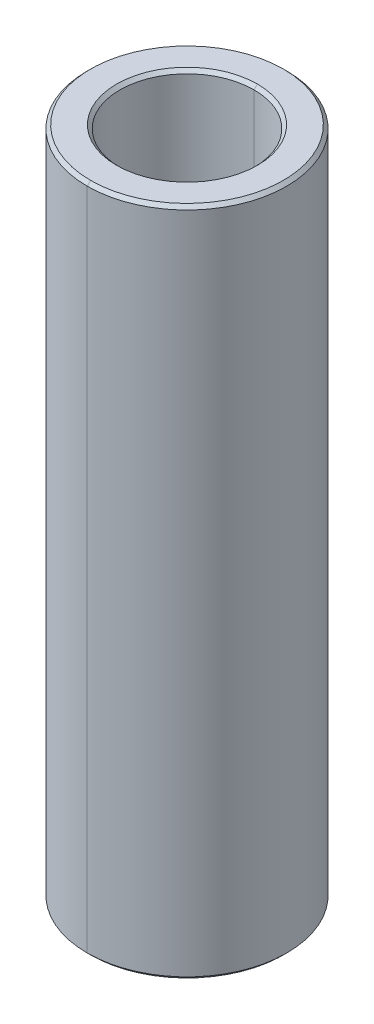
ISO-10303-21;
HEADER;
FILE_DESCRIPTION(('STEP AP214'),'2;1');
FILE_NAME('part.step','',(''),(''),'','','');
FILE_SCHEMA(('AUTOMOTIVE_DESIGN { 1 0 10303 214 1 1 1 1 }'));
ENDSEC;
DATA;
#1=APPLICATION_CONTEXT('core data for automotive mechanical design processes');
#2=APPLICATION_PROTOCOL_DEFINITION('international standard','automotive_design',2000,#1);
#3=PRODUCT_CONTEXT('',#1,'mechanical');
#4=PRODUCT('Part','Part','',(#3));
#5=PRODUCT_RELATED_PRODUCT_CATEGORY('part','',(#4));
#6=PRODUCT_DEFINITION_FORMATION('','',#4);
#7=PRODUCT_DEFINITION_CONTEXT('part definition',#1,'design');
#8=PRODUCT_DEFINITION('design','',#6,#7);
#9=PRODUCT_DEFINITION_SHAPE('','',#8);
#10=(LENGTH_UNIT() NAMED_UNIT(*) SI_UNIT(.MILLI.,.METRE.));
#11=(NAMED_UNIT(*) PLANE_ANGLE_UNIT() SI_UNIT($,.RADIAN.));
#12=(NAMED_UNIT(*) SI_UNIT($,.STERADIAN.) SOLID_ANGLE_UNIT());
#13=UNCERTAINTY_MEASURE_WITH_UNIT(LENGTH_MEASURE(1.E-05),#10,'distance_accuracy_value','');
#14=(GEOMETRIC_REPRESENTATION_CONTEXT(3) GLOBAL_UNCERTAINTY_ASSIGNED_CONTEXT((#13)) GLOBAL_UNIT_ASSIGNED_CONTEXT((#10,
#11,#12)) REPRESENTATION_CONTEXT('',''));
#15=CARTESIAN_POINT('',(0.,0.,0.));
#16=DIRECTION('',(0.,0.,1.));
#17=DIRECTION('',(1.,0.,0.));
#18=AXIS2_PLACEMENT_3D('',#15,#16,#17);
#19=CARTESIAN_POINT('',(0.,9.9,0.));
#20=DIRECTION('',(0.,1.,0.));
#21=DIRECTION('',(0.,0.,1.));
#22=AXIS2_PLACEMENT_3D('',#19,#20,#21);
#23=CONICAL_SURFACE('',#22,2.,0.785398163397448);
#24=DIRECTION('',(0.,0.707106781186548,-0.707106781186548));
#25=VECTOR('',#24,1.);
#26=CARTESIAN_POINT('',(0.,9.9,-2.));
#27=LINE('',#26,#25);
#28=CARTESIAN_POINT('',(0.,9.9,-2.));
#29=VERTEX_POINT('',#28);
#30=CARTESIAN_POINT('',(0.,10.,-2.1));
#31=VERTEX_POINT('',#30);
#32=EDGE_CURVE('E184',#29,#31,#27,.T.);
#33=ORIENTED_EDGE('',*,*,#32,.F.);
#34=CARTESIAN_POINT('',(0.,9.9,0.));
#35=DIRECTION('',(0.,1.,0.));
#36=DIRECTION('',(0.,0.,1.));
#37=AXIS2_PLACEMENT_3D('',#34,#35,#36);
#38=CIRCLE('',#37,2.);
#39=CARTESIAN_POINT('',(0.,9.9,2.));
#40=VERTEX_POINT('',#39);
#41=EDGE_CURVE('E26',#40,#29,#38,.T.);
#42=ORIENTED_EDGE('',*,*,#41,.F.);
#43=DIRECTION('',(0.,0.707106781186548,0.707106781186548));
#44=VECTOR('',#43,1.);
#45=CARTESIAN_POINT('',(0.,9.9,2.));
#46=LINE('',#45,#44);
#47=CARTESIAN_POINT('',(0.,10.,2.1));
#48=VERTEX_POINT('',#47);
#49=EDGE_CURVE('E192',#40,#48,#46,.T.);
#50=ORIENTED_EDGE('',*,*,#49,.T.);
#51=CARTESIAN_POINT('',(0.,10.,0.));
#52=DIRECTION('',(0.,-1.,0.));
#53=DIRECTION('',(0.,0.,1.));
#54=AXIS2_PLACEMENT_3D('',#51,#52,#53);
#55=CIRCLE('',#54,2.1);
#56=EDGE_CURVE('E159',#31,#48,#55,.T.);
#57=ORIENTED_EDGE('',*,*,#56,.F.);
#58=EDGE_LOOP('',(#33,#42,#50,#57));
#59=FACE_BOUND('',#58,.T.);
#60=ADVANCED_FACE('F15',(#59),#23,.F.);
#61=CARTESIAN_POINT('',(0.,-10.,0.));
#62=DIRECTION('',(0.,-1.,0.));
#63=DIRECTION('',(0.,0.,-1.));
#64=AXIS2_PLACEMENT_3D('',#61,#62,#63);
#65=CONICAL_SURFACE('',#64,2.1,0.785398163397448);
#66=DIRECTION('',(0.,-0.707106781186548,0.707106781186548));
#67=VECTOR('',#66,1.);
#68=CARTESIAN_POINT('',(0.,-10.,2.1));
#69=LINE('',#68,#67);
#70=CARTESIAN_POINT('',(0.,-9.9,2.));
#71=VERTEX_POINT('',#70);
#72=CARTESIAN_POINT('',(0.,-10.,2.1));
#73=VERTEX_POINT('',#72);
#74=EDGE_CURVE('E177',#71,#73,#69,.T.);
#75=ORIENTED_EDGE('',*,*,#74,.F.);
#76=CARTESIAN_POINT('',(0.,-9.9,0.));
#77=DIRECTION('',(0.,-1.,0.));
#78=DIRECTION('',(0.,0.,1.));
#79=AXIS2_PLACEMENT_3D('',#76,#77,#78);
#80=CIRCLE('',#79,2.);
#81=CARTESIAN_POINT('',(0.,-9.9,-2.));
#82=VERTEX_POINT('',#81);
#83=EDGE_CURVE('E10',#82,#71,#80,.T.);
#84=ORIENTED_EDGE('',*,*,#83,.F.);
#85=DIRECTION('',(0.,-0.707106781186548,-0.707106781186548));
#86=VECTOR('',#85,1.);
#87=CARTESIAN_POINT('',(0.,-10.,-2.1));
#88=LINE('',#87,#86);
#89=CARTESIAN_POINT('',(0.,-10.,-2.1));
#90=VERTEX_POINT('',#89);
#91=EDGE_CURVE('E155',#82,#90,#88,.T.);
#92=ORIENTED_EDGE('',*,*,#91,.T.);
#93=CARTESIAN_POINT('',(0.,-10.,0.));
#94=DIRECTION('',(0.,1.,0.));
#95=DIRECTION('',(0.,0.,1.));
#96=AXIS2_PLACEMENT_3D('',#93,#94,#95);
#97=CIRCLE('',#96,2.1);
#98=EDGE_CURVE('E107',#73,#90,#97,.T.);
#99=ORIENTED_EDGE('',*,*,#98,.F.);
#100=EDGE_LOOP('',(#75,#84,#92,#99));
#101=FACE_BOUND('',#100,.T.);
#102=ADVANCED_FACE('F293',(#101),#65,.F.);
#103=CARTESIAN_POINT('',(0.,10.,0.));
#104=DIRECTION('',(0.,-1.,0.));
#105=DIRECTION('',(0.,0.,-1.));
#106=AXIS2_PLACEMENT_3D('',#103,#104,#105);
#107=CONICAL_SURFACE('',#106,2.875,0.78539816339744);
#108=DIRECTION('',(0.,-0.707106781186554,0.707106781186542));
#109=VECTOR('',#108,1.);
#110=CARTESIAN_POINT('',(0.,10.,2.875));
#111=LINE('',#110,#109);
#112=CARTESIAN_POINT('',(0.,10.,2.875));
#113=VERTEX_POINT('',#112);
#114=CARTESIAN_POINT('',(0.,9.9,2.975));
#115=VERTEX_POINT('',#114);
#116=EDGE_CURVE('E125',#113,#115,#111,.T.);
#117=ORIENTED_EDGE('',*,*,#116,.F.);
#118=CARTESIAN_POINT('',(0.,10.,0.));
#119=DIRECTION('',(0.,1.,0.));
#120=DIRECTION('',(0.,0.,1.));
#121=AXIS2_PLACEMENT_3D('',#118,#119,#120);
#122=CIRCLE('',#121,2.875);
#123=CARTESIAN_POINT('',(0.,10.,-2.875));
#124=VERTEX_POINT('',#123);
#125=EDGE_CURVE('E96',#124,#113,#122,.T.);
#126=ORIENTED_EDGE('',*,*,#125,.F.);
#127=DIRECTION('',(0.,-0.707106781186554,-0.707106781186542));
#128=VECTOR('',#127,1.);
#129=CARTESIAN_POINT('',(0.,10.,-2.875));
#130=LINE('',#129,#128);
#131=CARTESIAN_POINT('',(0.,9.9,-2.975));
#132=VERTEX_POINT('',#131);
#133=EDGE_CURVE('E128',#124,#132,#130,.T.);
#134=ORIENTED_EDGE('',*,*,#133,.T.);
#135=CARTESIAN_POINT('',(0.,9.9,0.));
#136=DIRECTION('',(0.,-1.,0.));
#137=DIRECTION('',(0.,0.,1.));
#138=AXIS2_PLACEMENT_3D('',#135,#136,#137);
#139=CIRCLE('',#138,2.975);
#140=EDGE_CURVE('E116',#115,#132,#139,.T.);
#141=ORIENTED_EDGE('',*,*,#140,.F.);
#142=EDGE_LOOP('',(#117,#126,#134,#141));
#143=FACE_BOUND('',#142,.T.);
#144=ADVANCED_FACE('F123',(#143),#107,.T.);
#145=CARTESIAN_POINT('',(0.,-9.9,0.));
#146=DIRECTION('',(0.,1.,0.));
#147=DIRECTION('',(0.,0.,1.));
#148=AXIS2_PLACEMENT_3D('',#145,#146,#147);
#149=CONICAL_SURFACE('',#148,2.975,0.78539816339744);
#150=DIRECTION('',(0.,0.707106781186554,-0.707106781186542));
#151=VECTOR('',#150,1.);
#152=CARTESIAN_POINT('',(0.,-9.9,-2.975));
#153=LINE('',#152,#151);
#154=CARTESIAN_POINT('',(0.,-10.,-2.875));
#155=VERTEX_POINT('',#154);
#156=CARTESIAN_POINT('',(0.,-9.9,-2.975));
#157=VERTEX_POINT('',#156);
#158=EDGE_CURVE('E195',#155,#157,#153,.T.);
#159=ORIENTED_EDGE('',*,*,#158,.F.);
#160=CARTESIAN_POINT('',(0.,-10.,0.));
#161=DIRECTION('',(0.,-1.,0.));
#162=DIRECTION('',(0.,0.,1.));
#163=AXIS2_PLACEMENT_3D('',#160,#161,#162);
#164=CIRCLE('',#163,2.875);
#165=CARTESIAN_POINT('',(0.,-10.,2.875));
#166=VERTEX_POINT('',#165);
#167=EDGE_CURVE('E161',#166,#155,#164,.T.);
#168=ORIENTED_EDGE('',*,*,#167,.F.);
#169=DIRECTION('',(0.,0.707106781186554,0.707106781186542));
#170=VECTOR('',#169,1.);
#171=CARTESIAN_POINT('',(0.,-9.9,2.975));
#172=LINE('',#171,#170);
#173=CARTESIAN_POINT('',(0.,-9.9,2.975));
#174=VERTEX_POINT('',#173);
#175=EDGE_CURVE('E19',#166,#174,#172,.T.);
#176=ORIENTED_EDGE('',*,*,#175,.T.);
#177=CARTESIAN_POINT('',(0.,-9.9,0.));
#178=DIRECTION('',(0.,1.,0.));
#179=DIRECTION('',(0.,0.,1.));
#180=AXIS2_PLACEMENT_3D('',#177,#178,#179);
#181=CIRCLE('',#180,2.975);
#182=EDGE_CURVE('E41',#157,#174,#181,.T.);
#183=ORIENTED_EDGE('',*,*,#182,.F.);
#184=EDGE_LOOP('',(#159,#168,#176,#183));
#185=FACE_BOUND('',#184,.T.);
#186=ADVANCED_FACE('F17',(#185),#149,.T.);
#187=CARTESIAN_POINT('',(0.,10.,0.));
#188=DIRECTION('',(0.,-1.,0.));
#189=DIRECTION('',(0.,0.,-1.));
#190=AXIS2_PLACEMENT_3D('',#187,#188,#189);
#191=CYLINDRICAL_SURFACE('',#190,2.);
#192=DIRECTION('',(0.,-1.,0.));
#193=VECTOR('',#192,1.);
#194=CARTESIAN_POINT('',(0.,10.,2.));
#195=LINE('',#194,#193);
#196=EDGE_CURVE('E272',#40,#71,#195,.T.);
#197=ORIENTED_EDGE('',*,*,#196,.F.);
#198=ORIENTED_EDGE('',*,*,#41,.T.);
#199=DIRECTION('',(0.,-1.,0.));
#200=VECTOR('',#199,1.);
#201=CARTESIAN_POINT('',(0.,10.,-2.));
#202=LINE('',#201,#200);
#203=EDGE_CURVE('E140',#29,#82,#202,.T.);
#204=ORIENTED_EDGE('',*,*,#203,.T.);
#205=ORIENTED_EDGE('',*,*,#83,.T.);
#206=EDGE_LOOP('',(#197,#198,#204,#205));
#207=FACE_BOUND('',#206,.T.);
#208=ADVANCED_FACE('F359',(#207),#191,.F.);
#209=CARTESIAN_POINT('',(0.,10.,0.));
#210=DIRECTION('',(0.,-1.,0.));
#211=DIRECTION('',(0.,0.,-1.));
#212=AXIS2_PLACEMENT_3D('',#209,#210,#211);
#213=CYLINDRICAL_SURFACE('',#212,2.975);
#214=DIRECTION('',(0.,-1.,0.));
#215=VECTOR('',#214,1.);
#216=CARTESIAN_POINT('',(0.,10.,2.975));
#217=LINE('',#216,#215);
#218=EDGE_CURVE('E132',#115,#174,#217,.T.);
#219=ORIENTED_EDGE('',*,*,#218,.F.);
#220=ORIENTED_EDGE('',*,*,#140,.T.);
#221=DIRECTION('',(0.,-1.,0.));
#222=VECTOR('',#221,1.);
#223=CARTESIAN_POINT('',(0.,10.,-2.975));
#224=LINE('',#223,#222);
#225=EDGE_CURVE('E139',#132,#157,#224,.T.);
#226=ORIENTED_EDGE('',*,*,#225,.T.);
#227=ORIENTED_EDGE('',*,*,#182,.T.);
#228=EDGE_LOOP('',(#219,#220,#226,#227));
#229=FACE_BOUND('',#228,.T.);
#230=ADVANCED_FACE('F134',(#229),#213,.T.);
#231=CARTESIAN_POINT('',(0.,-10.,0.));
#232=DIRECTION('',(0.,1.,0.));
#233=DIRECTION('',(1.,0.,0.));
#234=AXIS2_PLACEMENT_3D('',#231,#232,#233);
#235=PLANE('',#234);
#236=CARTESIAN_POINT('',(0.,-10.,0.));
#237=DIRECTION('',(0.,1.,0.));
#238=DIRECTION('',(0.,0.,1.));
#239=AXIS2_PLACEMENT_3D('',#236,#237,#238);
#240=CIRCLE('',#239,2.1);
#241=EDGE_CURVE('E179',#90,#73,#240,.T.);
#242=ORIENTED_EDGE('',*,*,#241,.T.);
#243=ORIENTED_EDGE('',*,*,#98,.T.);
#244=EDGE_LOOP('',(#242,#243));
#245=FACE_BOUND('',#244,.T.);
#246=ORIENTED_EDGE('',*,*,#167,.T.);
#247=CARTESIAN_POINT('',(0.,-10.,0.));
#248=DIRECTION('',(0.,-1.,0.));
#249=DIRECTION('',(0.,0.,1.));
#250=AXIS2_PLACEMENT_3D('',#247,#248,#249);
#251=CIRCLE('',#250,2.875);
#252=EDGE_CURVE('E193',#155,#166,#251,.T.);
#253=ORIENTED_EDGE('',*,*,#252,.T.);
#254=EDGE_LOOP('',(#246,#253));
#255=FACE_BOUND('',#254,.T.);
#256=ADVANCED_FACE('F312',(#245,#255),#235,.F.);
#257=CARTESIAN_POINT('',(0.,10.,0.));
#258=DIRECTION('',(0.,1.,0.));
#259=DIRECTION('',(1.,0.,0.));
#260=AXIS2_PLACEMENT_3D('',#257,#258,#259);
#261=PLANE('',#260);
#262=CARTESIAN_POINT('',(0.,10.,0.));
#263=DIRECTION('',(0.,-1.,0.));
#264=DIRECTION('',(0.,0.,1.));
#265=AXIS2_PLACEMENT_3D('',#262,#263,#264);
#266=CIRCLE('',#265,2.1);
#267=EDGE_CURVE('E188',#48,#31,#266,.T.);
#268=ORIENTED_EDGE('',*,*,#267,.T.);
#269=ORIENTED_EDGE('',*,*,#56,.T.);
#270=EDGE_LOOP('',(#268,#269));
#271=FACE_BOUND('',#270,.T.);
#272=ORIENTED_EDGE('',*,*,#125,.T.);
#273=CARTESIAN_POINT('',(0.,10.,0.));
#274=DIRECTION('',(0.,1.,0.));
#275=DIRECTION('',(0.,0.,1.));
#276=AXIS2_PLACEMENT_3D('',#273,#274,#275);
#277=CIRCLE('',#276,2.875);
#278=EDGE_CURVE('E147',#113,#124,#277,.T.);
#279=ORIENTED_EDGE('',*,*,#278,.T.);
#280=EDGE_LOOP('',(#272,#279));
#281=FACE_BOUND('',#280,.T.);
#282=ADVANCED_FACE('F288',(#271,#281),#261,.T.);
#283=CARTESIAN_POINT('',(0.,10.,0.));
#284=DIRECTION('',(0.,-1.,0.));
#285=DIRECTION('',(0.,0.,-1.));
#286=AXIS2_PLACEMENT_3D('',#283,#284,#285);
#287=CYLINDRICAL_SURFACE('',#286,2.975);
#288=CARTESIAN_POINT('',(0.,9.9,0.));
#289=DIRECTION('',(0.,-1.,0.));
#290=DIRECTION('',(0.,0.,1.));
#291=AXIS2_PLACEMENT_3D('',#288,#289,#290);
#292=CIRCLE('',#291,2.975);
#293=EDGE_CURVE('E141',#132,#115,#292,.T.);
#294=ORIENTED_EDGE('',*,*,#293,.T.);
#295=ORIENTED_EDGE('',*,*,#218,.T.);
#296=CARTESIAN_POINT('',(0.,-9.9,0.));
#297=DIRECTION('',(0.,1.,0.));
#298=DIRECTION('',(0.,0.,1.));
#299=AXIS2_PLACEMENT_3D('',#296,#297,#298);
#300=CIRCLE('',#299,2.975);
#301=EDGE_CURVE('E201',#174,#157,#300,.T.);
#302=ORIENTED_EDGE('',*,*,#301,.T.);
#303=ORIENTED_EDGE('',*,*,#225,.F.);
#304=EDGE_LOOP('',(#294,#295,#302,#303));
#305=FACE_BOUND('',#304,.T.);
#306=ADVANCED_FACE('F142',(#305),#287,.T.);
#307=CARTESIAN_POINT('',(0.,10.,0.));
#308=DIRECTION('',(0.,-1.,0.));
#309=DIRECTION('',(0.,0.,-1.));
#310=AXIS2_PLACEMENT_3D('',#307,#308,#309);
#311=CYLINDRICAL_SURFACE('',#310,2.);
#312=CARTESIAN_POINT('',(0.,9.9,0.));
#313=DIRECTION('',(0.,1.,0.));
#314=DIRECTION('',(0.,0.,1.));
#315=AXIS2_PLACEMENT_3D('',#312,#313,#314);
#316=CIRCLE('',#315,2.);
#317=EDGE_CURVE('E189',#29,#40,#316,.T.);
#318=ORIENTED_EDGE('',*,*,#317,.T.);
#319=ORIENTED_EDGE('',*,*,#196,.T.);
#320=CARTESIAN_POINT('',(0.,-9.9,0.));
#321=DIRECTION('',(0.,-1.,0.));
#322=DIRECTION('',(0.,0.,1.));
#323=AXIS2_PLACEMENT_3D('',#320,#321,#322);
#324=CIRCLE('',#323,2.);
#325=EDGE_CURVE('E180',#71,#82,#324,.T.);
#326=ORIENTED_EDGE('',*,*,#325,.T.);
#327=ORIENTED_EDGE('',*,*,#203,.F.);
#328=EDGE_LOOP('',(#318,#319,#326,#327));
#329=FACE_BOUND('',#328,.T.);
#330=ADVANCED_FACE('F279',(#329),#311,.F.);
#331=CARTESIAN_POINT('',(0.,-9.9,0.));
#332=DIRECTION('',(0.,1.,0.));
#333=DIRECTION('',(0.,0.,1.));
#334=AXIS2_PLACEMENT_3D('',#331,#332,#333);
#335=CONICAL_SURFACE('',#334,2.975,0.78539816339744);
#336=ORIENTED_EDGE('',*,*,#252,.F.);
#337=ORIENTED_EDGE('',*,*,#158,.T.);
#338=ORIENTED_EDGE('',*,*,#301,.F.);
#339=ORIENTED_EDGE('',*,*,#175,.F.);
#340=EDGE_LOOP('',(#336,#337,#338,#339));
#341=FACE_BOUND('',#340,.T.);
#342=ADVANCED_FACE('F275',(#341),#335,.T.);
#343=CARTESIAN_POINT('',(0.,10.,0.));
#344=DIRECTION('',(0.,-1.,0.));
#345=DIRECTION('',(0.,0.,-1.));
#346=AXIS2_PLACEMENT_3D('',#343,#344,#345);
#347=CONICAL_SURFACE('',#346,2.875,0.78539816339744);
#348=ORIENTED_EDGE('',*,*,#278,.F.);
#349=ORIENTED_EDGE('',*,*,#116,.T.);
#350=ORIENTED_EDGE('',*,*,#293,.F.);
#351=ORIENTED_EDGE('',*,*,#133,.F.);
#352=EDGE_LOOP('',(#348,#349,#350,#351));
#353=FACE_BOUND('',#352,.T.);
#354=ADVANCED_FACE('F146',(#353),#347,.T.);
#355=CARTESIAN_POINT('',(0.,-10.,0.));
#356=DIRECTION('',(0.,-1.,0.));
#357=DIRECTION('',(0.,0.,-1.));
#358=AXIS2_PLACEMENT_3D('',#355,#356,#357);
#359=CONICAL_SURFACE('',#358,2.1,0.785398163397448);
#360=ORIENTED_EDGE('',*,*,#325,.F.);
#361=ORIENTED_EDGE('',*,*,#74,.T.);
#362=ORIENTED_EDGE('',*,*,#241,.F.);
#363=ORIENTED_EDGE('',*,*,#91,.F.);
#364=EDGE_LOOP('',(#360,#361,#362,#363));
#365=FACE_BOUND('',#364,.T.);
#366=ADVANCED_FACE('F318',(#365),#359,.F.);
#367=CARTESIAN_POINT('',(0.,9.9,0.));
#368=DIRECTION('',(0.,1.,0.));
#369=DIRECTION('',(0.,0.,1.));
#370=AXIS2_PLACEMENT_3D('',#367,#368,#369);
#371=CONICAL_SURFACE('',#370,2.,0.785398163397448);
#372=ORIENTED_EDGE('',*,*,#317,.F.);
#373=ORIENTED_EDGE('',*,*,#32,.T.);
#374=ORIENTED_EDGE('',*,*,#267,.F.);
#375=ORIENTED_EDGE('',*,*,#49,.F.);
#376=EDGE_LOOP('',(#372,#373,#374,#375));
#377=FACE_BOUND('',#376,.T.);
#378=ADVANCED_FACE('F322',(#377),#371,.F.);
#379=CLOSED_SHELL('',(#60,#102,#144,#186,#208,#230,#256,#282,#306,#330,#342,#354,#366,#378));
#380=MANIFOLD_SOLID_BREP('B1',#379);
#381=ADVANCED_BREP_SHAPE_REPRESENTATION('',(#18,#380),#14);
#382=SHAPE_DEFINITION_REPRESENTATION(#9,#381);
ENDSEC;
END-ISO-10303-21;
